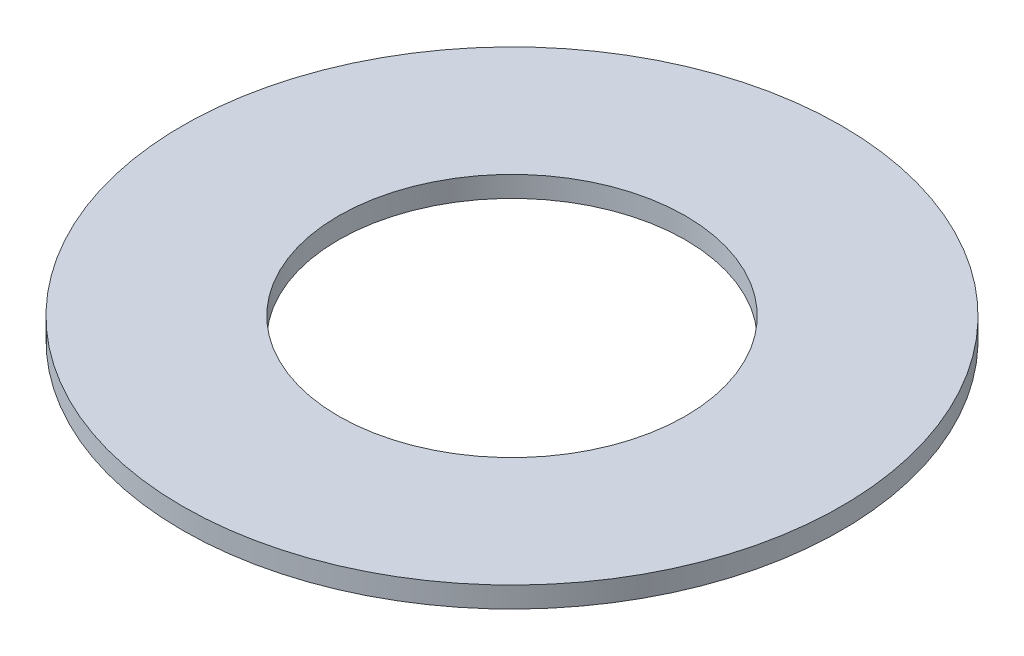
ISO-10303-21;
HEADER;
FILE_DESCRIPTION(('STEP AP214'),'2;1');
FILE_NAME('part.step','',(''),(''),'','','');
FILE_SCHEMA(('AUTOMOTIVE_DESIGN { 1 0 10303 214 1 1 1 1 }'));
ENDSEC;
DATA;
#1=APPLICATION_CONTEXT('core data for automotive mechanical design processes');
#2=APPLICATION_PROTOCOL_DEFINITION('international standard','automotive_design',2000,#1);
#3=PRODUCT_CONTEXT('',#1,'mechanical');
#4=PRODUCT('Part','Part','',(#3));
#5=PRODUCT_RELATED_PRODUCT_CATEGORY('part','',(#4));
#6=PRODUCT_DEFINITION_FORMATION('','',#4);
#7=PRODUCT_DEFINITION_CONTEXT('part definition',#1,'design');
#8=PRODUCT_DEFINITION('design','',#6,#7);
#9=PRODUCT_DEFINITION_SHAPE('','',#8);
#10=(LENGTH_UNIT() NAMED_UNIT(*) SI_UNIT(.MILLI.,.METRE.));
#11=(NAMED_UNIT(*) PLANE_ANGLE_UNIT() SI_UNIT($,.RADIAN.));
#12=(NAMED_UNIT(*) SI_UNIT($,.STERADIAN.) SOLID_ANGLE_UNIT());
#13=UNCERTAINTY_MEASURE_WITH_UNIT(LENGTH_MEASURE(1.E-05),#10,'distance_accuracy_value','');
#14=(GEOMETRIC_REPRESENTATION_CONTEXT(3) GLOBAL_UNCERTAINTY_ASSIGNED_CONTEXT((#13)) GLOBAL_UNIT_ASSIGNED_CONTEXT((#10,
#11,#12)) REPRESENTATION_CONTEXT('',''));
#15=CARTESIAN_POINT('',(0.,0.,0.));
#16=DIRECTION('',(0.,0.,1.));
#17=DIRECTION('',(1.,0.,0.));
#18=AXIS2_PLACEMENT_3D('',#15,#16,#17);
#19=CARTESIAN_POINT('',(0.,6.,0.));
#20=DIRECTION('',(0.,-1.,0.));
#21=DIRECTION('',(0.,0.,-1.));
#22=AXIS2_PLACEMENT_3D('',#19,#20,#21);
#23=CYLINDRICAL_SURFACE('',#22,95.);
#24=CARTESIAN_POINT('',(0.,6.,0.));
#25=DIRECTION('',(0.,1.,0.));
#26=DIRECTION('',(0.,0.,1.));
#27=AXIS2_PLACEMENT_3D('',#24,#25,#26);
#28=CIRCLE('',#27,95.);
#29=CARTESIAN_POINT('',(0.,6.,95.));
#30=VERTEX_POINT('',#29);
#31=EDGE_CURVE('E10',#30,#30,#28,.T.);
#32=ORIENTED_EDGE('',*,*,#31,.F.);
#33=EDGE_LOOP('',(#32));
#34=FACE_BOUND('',#33,.T.);
#35=CARTESIAN_POINT('',(0.,0.,0.));
#36=DIRECTION('',(0.,1.,0.));
#37=DIRECTION('',(0.,0.,1.));
#38=AXIS2_PLACEMENT_3D('',#35,#36,#37);
#39=CIRCLE('',#38,95.);
#40=CARTESIAN_POINT('',(0.,0.,95.));
#41=VERTEX_POINT('',#40);
#42=EDGE_CURVE('E37',#41,#41,#39,.T.);
#43=ORIENTED_EDGE('',*,*,#42,.T.);
#44=EDGE_LOOP('',(#43));
#45=FACE_BOUND('',#44,.T.);
#46=ADVANCED_FACE('F40',(#34,#45),#23,.T.);
#47=CARTESIAN_POINT('',(0.,6.,0.));
#48=DIRECTION('',(0.,1.,0.));
#49=DIRECTION('',(0.,0.,1.));
#50=AXIS2_PLACEMENT_3D('',#47,#48,#49);
#51=PLANE('',#50);
#52=CARTESIAN_POINT('',(0.,6.,0.));
#53=DIRECTION('',(0.,1.,0.));
#54=DIRECTION('',(0.,0.,1.));
#55=AXIS2_PLACEMENT_3D('',#52,#53,#54);
#56=CIRCLE('',#55,50.);
#57=CARTESIAN_POINT('',(0.,6.,50.));
#58=VERTEX_POINT('',#57);
#59=EDGE_CURVE('E50',#58,#58,#56,.T.);
#60=ORIENTED_EDGE('',*,*,#59,.F.);
#61=EDGE_LOOP('',(#60));
#62=FACE_BOUND('',#61,.T.);
#63=ORIENTED_EDGE('',*,*,#31,.T.);
#64=EDGE_LOOP('',(#63));
#65=FACE_BOUND('',#64,.T.);
#66=ADVANCED_FACE('F59',(#62,#65),#51,.T.);
#67=CARTESIAN_POINT('',(0.,0.,0.));
#68=DIRECTION('',(0.,1.,0.));
#69=DIRECTION('',(0.,0.,1.));
#70=AXIS2_PLACEMENT_3D('',#67,#68,#69);
#71=PLANE('',#70);
#72=CARTESIAN_POINT('',(0.,0.,0.));
#73=DIRECTION('',(0.,1.,0.));
#74=DIRECTION('',(0.,0.,1.));
#75=AXIS2_PLACEMENT_3D('',#72,#73,#74);
#76=CIRCLE('',#75,50.);
#77=CARTESIAN_POINT('',(0.,0.,50.));
#78=VERTEX_POINT('',#77);
#79=EDGE_CURVE('E47',#78,#78,#76,.T.);
#80=ORIENTED_EDGE('',*,*,#79,.T.);
#81=EDGE_LOOP('',(#80));
#82=FACE_BOUND('',#81,.T.);
#83=ORIENTED_EDGE('',*,*,#42,.F.);
#84=EDGE_LOOP('',(#83));
#85=FACE_BOUND('',#84,.T.);
#86=ADVANCED_FACE('F58',(#82,#85),#71,.F.);
#87=CARTESIAN_POINT('',(0.,6.,0.));
#88=DIRECTION('',(0.,-1.,0.));
#89=DIRECTION('',(0.,0.,-1.));
#90=AXIS2_PLACEMENT_3D('',#87,#88,#89);
#91=CYLINDRICAL_SURFACE('',#90,50.);
#92=ORIENTED_EDGE('',*,*,#59,.T.);
#93=EDGE_LOOP('',(#92));
#94=FACE_BOUND('',#93,.T.);
#95=ORIENTED_EDGE('',*,*,#79,.F.);
#96=EDGE_LOOP('',(#95));
#97=FACE_BOUND('',#96,.T.);
#98=ADVANCED_FACE('F54',(#94,#97),#91,.F.);
#99=CLOSED_SHELL('',(#46,#66,#86,#98));
#100=MANIFOLD_SOLID_BREP('B2',#99);
#101=ADVANCED_BREP_SHAPE_REPRESENTATION('',(#18,#100),#14);
#102=SHAPE_DEFINITION_REPRESENTATION(#9,#101);
ENDSEC;
END-ISO-10303-21;
